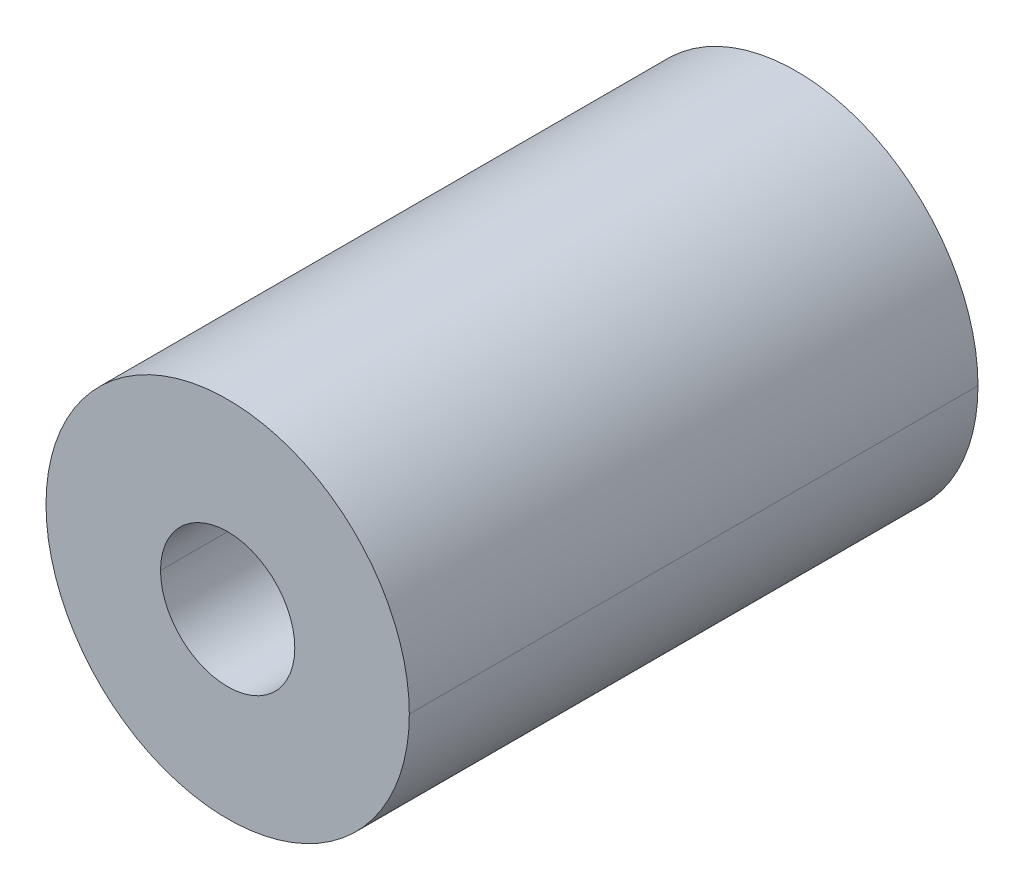
ISO-10303-21;
HEADER;
FILE_DESCRIPTION(('STEP AP214'),'2;1');
FILE_NAME('part.step','',(''),(''),'','','');
FILE_SCHEMA(('AUTOMOTIVE_DESIGN { 1 0 10303 214 1 1 1 1 }'));
ENDSEC;
DATA;
#1=APPLICATION_CONTEXT('core data for automotive mechanical design processes');
#2=APPLICATION_PROTOCOL_DEFINITION('international standard','automotive_design',2000,#1);
#3=PRODUCT_CONTEXT('',#1,'mechanical');
#4=PRODUCT('Part','Part','',(#3));
#5=PRODUCT_RELATED_PRODUCT_CATEGORY('part','',(#4));
#6=PRODUCT_DEFINITION_FORMATION('','',#4);
#7=PRODUCT_DEFINITION_CONTEXT('part definition',#1,'design');
#8=PRODUCT_DEFINITION('design','',#6,#7);
#9=PRODUCT_DEFINITION_SHAPE('','',#8);
#10=(LENGTH_UNIT() NAMED_UNIT(*) SI_UNIT(.MILLI.,.METRE.));
#11=(NAMED_UNIT(*) PLANE_ANGLE_UNIT() SI_UNIT($,.RADIAN.));
#12=(NAMED_UNIT(*) SI_UNIT($,.STERADIAN.) SOLID_ANGLE_UNIT());
#13=UNCERTAINTY_MEASURE_WITH_UNIT(LENGTH_MEASURE(1.E-05),#10,'distance_accuracy_value','');
#14=(GEOMETRIC_REPRESENTATION_CONTEXT(3) GLOBAL_UNCERTAINTY_ASSIGNED_CONTEXT((#13)) GLOBAL_UNIT_ASSIGNED_CONTEXT((#10,
#11,#12)) REPRESENTATION_CONTEXT('',''));
#15=CARTESIAN_POINT('',(0.,0.,0.));
#16=DIRECTION('',(0.,0.,1.));
#17=DIRECTION('',(1.,0.,0.));
#18=AXIS2_PLACEMENT_3D('',#15,#16,#17);
#19=CARTESIAN_POINT('',(0.,0.,7.2));
#20=DIRECTION('',(0.,0.,-1.));
#21=DIRECTION('',(-1.,0.,0.));
#22=AXIS2_PLACEMENT_3D('',#19,#20,#21);
#23=CYLINDRICAL_SURFACE('',#22,0.85);
#24=CARTESIAN_POINT('',(0.,0.,7.2));
#25=DIRECTION('',(0.,0.,1.));
#26=DIRECTION('',(1.,0.,0.));
#27=AXIS2_PLACEMENT_3D('',#24,#25,#26);
#28=CIRCLE('',#27,0.85);
#29=CARTESIAN_POINT('',(-0.85,0.,7.2));
#30=VERTEX_POINT('',#29);
#31=CARTESIAN_POINT('',(0.85,0.,7.2));
#32=VERTEX_POINT('',#31);
#33=EDGE_CURVE('E11',#30,#32,#28,.T.);
#34=ORIENTED_EDGE('',*,*,#33,.T.);
#35=DIRECTION('',(0.,0.,-1.));
#36=VECTOR('',#35,1.);
#37=CARTESIAN_POINT('',(0.85,0.,7.2));
#38=LINE('',#37,#36);
#39=CARTESIAN_POINT('',(0.85,0.,0.));
#40=VERTEX_POINT('',#39);
#41=EDGE_CURVE('E81',#32,#40,#38,.T.);
#42=ORIENTED_EDGE('',*,*,#41,.T.);
#43=CARTESIAN_POINT('',(0.,0.,0.));
#44=DIRECTION('',(0.,0.,1.));
#45=DIRECTION('',(1.,0.,0.));
#46=AXIS2_PLACEMENT_3D('',#43,#44,#45);
#47=CIRCLE('',#46,0.85);
#48=CARTESIAN_POINT('',(-0.85,0.,0.));
#49=VERTEX_POINT('',#48);
#50=EDGE_CURVE('E75',#49,#40,#47,.T.);
#51=ORIENTED_EDGE('',*,*,#50,.F.);
#52=DIRECTION('',(0.,0.,-1.));
#53=VECTOR('',#52,1.);
#54=CARTESIAN_POINT('',(-0.85,0.,7.2));
#55=LINE('',#54,#53);
#56=EDGE_CURVE('E78',#30,#49,#55,.T.);
#57=ORIENTED_EDGE('',*,*,#56,.F.);
#58=EDGE_LOOP('',(#34,#42,#51,#57));
#59=FACE_BOUND('',#58,.T.);
#60=ADVANCED_FACE('F16',(#59),#23,.F.);
#61=CARTESIAN_POINT('',(0.,0.,7.2));
#62=DIRECTION('',(0.,0.,-1.));
#63=DIRECTION('',(-1.,0.,0.));
#64=AXIS2_PLACEMENT_3D('',#61,#62,#63);
#65=CYLINDRICAL_SURFACE('',#64,2.3);
#66=CARTESIAN_POINT('',(0.,0.,7.2));
#67=DIRECTION('',(0.,0.,1.));
#68=DIRECTION('',(1.,0.,0.));
#69=AXIS2_PLACEMENT_3D('',#66,#67,#68);
#70=CIRCLE('',#69,2.3);
#71=CARTESIAN_POINT('',(2.3,0.,7.2));
#72=VERTEX_POINT('',#71);
#73=CARTESIAN_POINT('',(-2.3,0.,7.2));
#74=VERTEX_POINT('',#73);
#75=EDGE_CURVE('E26',#72,#74,#70,.T.);
#76=ORIENTED_EDGE('',*,*,#75,.F.);
#77=DIRECTION('',(0.,0.,-1.));
#78=VECTOR('',#77,1.);
#79=CARTESIAN_POINT('',(2.3,0.,7.2));
#80=LINE('',#79,#78);
#81=CARTESIAN_POINT('',(2.3,0.,0.));
#82=VERTEX_POINT('',#81);
#83=EDGE_CURVE('E91',#72,#82,#80,.T.);
#84=ORIENTED_EDGE('',*,*,#83,.T.);
#85=CARTESIAN_POINT('',(0.,0.,0.));
#86=DIRECTION('',(0.,0.,1.));
#87=DIRECTION('',(1.,0.,0.));
#88=AXIS2_PLACEMENT_3D('',#85,#86,#87);
#89=CIRCLE('',#88,2.3);
#90=CARTESIAN_POINT('',(-2.3,0.,0.));
#91=VERTEX_POINT('',#90);
#92=EDGE_CURVE('E40',#82,#91,#89,.T.);
#93=ORIENTED_EDGE('',*,*,#92,.T.);
#94=DIRECTION('',(0.,0.,-1.));
#95=VECTOR('',#94,1.);
#96=CARTESIAN_POINT('',(-2.3,0.,7.2));
#97=LINE('',#96,#95);
#98=EDGE_CURVE('E112',#74,#91,#97,.T.);
#99=ORIENTED_EDGE('',*,*,#98,.F.);
#100=EDGE_LOOP('',(#76,#84,#93,#99));
#101=FACE_BOUND('',#100,.T.);
#102=ADVANCED_FACE('F123',(#101),#65,.T.);
#103=CARTESIAN_POINT('',(0.,0.,7.2));
#104=DIRECTION('',(0.,0.,1.));
#105=DIRECTION('',(1.,0.,0.));
#106=AXIS2_PLACEMENT_3D('',#103,#104,#105);
#107=PLANE('',#106);
#108=ORIENTED_EDGE('',*,*,#33,.F.);
#109=CARTESIAN_POINT('',(0.,0.,7.2));
#110=DIRECTION('',(0.,0.,1.));
#111=DIRECTION('',(1.,0.,0.));
#112=AXIS2_PLACEMENT_3D('',#109,#110,#111);
#113=CIRCLE('',#112,0.85);
#114=EDGE_CURVE('E95',#32,#30,#113,.T.);
#115=ORIENTED_EDGE('',*,*,#114,.F.);
#116=EDGE_LOOP('',(#108,#115));
#117=FACE_BOUND('',#116,.T.);
#118=CARTESIAN_POINT('',(0.,0.,7.2));
#119=DIRECTION('',(0.,0.,1.));
#120=DIRECTION('',(1.,0.,0.));
#121=AXIS2_PLACEMENT_3D('',#118,#119,#120);
#122=CIRCLE('',#121,2.3);
#123=EDGE_CURVE('E20',#74,#72,#122,.T.);
#124=ORIENTED_EDGE('',*,*,#123,.T.);
#125=ORIENTED_EDGE('',*,*,#75,.T.);
#126=EDGE_LOOP('',(#124,#125));
#127=FACE_BOUND('',#126,.T.);
#128=ADVANCED_FACE('F124',(#117,#127),#107,.T.);
#129=CARTESIAN_POINT('',(0.,0.,0.));
#130=DIRECTION('',(0.,0.,1.));
#131=DIRECTION('',(1.,0.,0.));
#132=AXIS2_PLACEMENT_3D('',#129,#130,#131);
#133=PLANE('',#132);
#134=ORIENTED_EDGE('',*,*,#50,.T.);
#135=CARTESIAN_POINT('',(0.,0.,0.));
#136=DIRECTION('',(0.,0.,1.));
#137=DIRECTION('',(1.,0.,0.));
#138=AXIS2_PLACEMENT_3D('',#135,#136,#137);
#139=CIRCLE('',#138,0.85);
#140=EDGE_CURVE('E86',#40,#49,#139,.T.);
#141=ORIENTED_EDGE('',*,*,#140,.T.);
#142=EDGE_LOOP('',(#134,#141));
#143=FACE_BOUND('',#142,.T.);
#144=CARTESIAN_POINT('',(0.,0.,0.));
#145=DIRECTION('',(0.,0.,1.));
#146=DIRECTION('',(1.,0.,0.));
#147=AXIS2_PLACEMENT_3D('',#144,#145,#146);
#148=CIRCLE('',#147,2.3);
#149=EDGE_CURVE('E110',#91,#82,#148,.T.);
#150=ORIENTED_EDGE('',*,*,#149,.F.);
#151=ORIENTED_EDGE('',*,*,#92,.F.);
#152=EDGE_LOOP('',(#150,#151));
#153=FACE_BOUND('',#152,.T.);
#154=ADVANCED_FACE('F87',(#143,#153),#133,.F.);
#155=CARTESIAN_POINT('',(0.,0.,7.2));
#156=DIRECTION('',(0.,0.,-1.));
#157=DIRECTION('',(-1.,0.,0.));
#158=AXIS2_PLACEMENT_3D('',#155,#156,#157);
#159=CYLINDRICAL_SURFACE('',#158,2.3);
#160=ORIENTED_EDGE('',*,*,#83,.F.);
#161=ORIENTED_EDGE('',*,*,#123,.F.);
#162=ORIENTED_EDGE('',*,*,#98,.T.);
#163=ORIENTED_EDGE('',*,*,#149,.T.);
#164=EDGE_LOOP('',(#160,#161,#162,#163));
#165=FACE_BOUND('',#164,.T.);
#166=ADVANCED_FACE('F18',(#165),#159,.T.);
#167=CARTESIAN_POINT('',(0.,0.,7.2));
#168=DIRECTION('',(0.,0.,-1.));
#169=DIRECTION('',(-1.,0.,0.));
#170=AXIS2_PLACEMENT_3D('',#167,#168,#169);
#171=CYLINDRICAL_SURFACE('',#170,0.85);
#172=ORIENTED_EDGE('',*,*,#41,.F.);
#173=ORIENTED_EDGE('',*,*,#114,.T.);
#174=ORIENTED_EDGE('',*,*,#56,.T.);
#175=ORIENTED_EDGE('',*,*,#140,.F.);
#176=EDGE_LOOP('',(#172,#173,#174,#175));
#177=FACE_BOUND('',#176,.T.);
#178=ADVANCED_FACE('F93',(#177),#171,.F.);
#179=CLOSED_SHELL('',(#60,#102,#128,#154,#166,#178));
#180=MANIFOLD_SOLID_BREP('B1',#179);
#181=ADVANCED_BREP_SHAPE_REPRESENTATION('',(#18,#180),#14);
#182=SHAPE_DEFINITION_REPRESENTATION(#9,#181);
ENDSEC;
END-ISO-10303-21;
